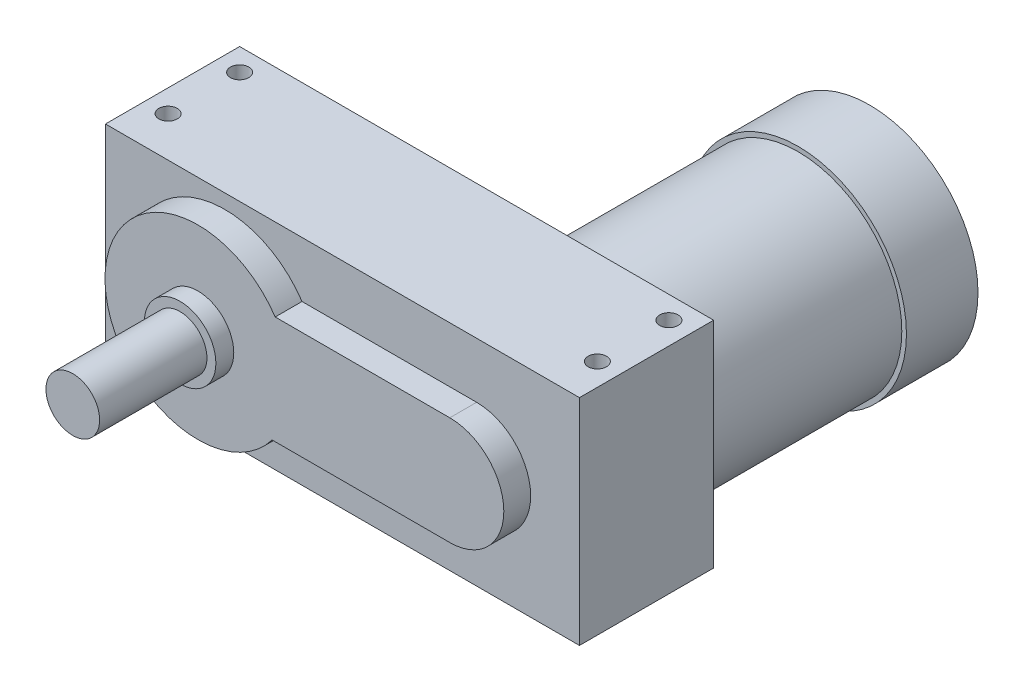
ISO-10303-21;
HEADER;
FILE_DESCRIPTION(('STEP AP214'),'2;1');
FILE_NAME('part.step','',(''),(''),'','','');
FILE_SCHEMA(('AUTOMOTIVE_DESIGN { 1 0 10303 214 1 1 1 1 }'));
ENDSEC;
DATA;
#1=APPLICATION_CONTEXT('core data for automotive mechanical design processes');
#2=APPLICATION_PROTOCOL_DEFINITION('international standard','automotive_design',2000,#1);
#3=PRODUCT_CONTEXT('',#1,'mechanical');
#4=PRODUCT('Part','Part','',(#3));
#5=PRODUCT_RELATED_PRODUCT_CATEGORY('part','',(#4));
#6=PRODUCT_DEFINITION_FORMATION('','',#4);
#7=PRODUCT_DEFINITION_CONTEXT('part definition',#1,'design');
#8=PRODUCT_DEFINITION('design','',#6,#7);
#9=PRODUCT_DEFINITION_SHAPE('','',#8);
#10=(LENGTH_UNIT() NAMED_UNIT(*) SI_UNIT(.MILLI.,.METRE.));
#11=(NAMED_UNIT(*) PLANE_ANGLE_UNIT() SI_UNIT($,.RADIAN.));
#12=(NAMED_UNIT(*) SI_UNIT($,.STERADIAN.) SOLID_ANGLE_UNIT());
#13=UNCERTAINTY_MEASURE_WITH_UNIT(LENGTH_MEASURE(1.E-05),#10,'distance_accuracy_value','');
#14=(GEOMETRIC_REPRESENTATION_CONTEXT(3) GLOBAL_UNCERTAINTY_ASSIGNED_CONTEXT((#13)) GLOBAL_UNIT_ASSIGNED_CONTEXT((#10,
#11,#12)) REPRESENTATION_CONTEXT('',''));
#15=CARTESIAN_POINT('',(0.,0.,0.));
#16=DIRECTION('',(0.,0.,1.));
#17=DIRECTION('',(1.,0.,0.));
#18=AXIS2_PLACEMENT_3D('',#15,#16,#17);
#19=CARTESIAN_POINT('',(-42.3672,38.1,-57.15));
#20=DIRECTION('',(-1.,0.,0.));
#21=DIRECTION('',(0.,0.,1.));
#22=AXIS2_PLACEMENT_3D('',#19,#20,#21);
#23=PLANE('',#22);
#24=DIRECTION('',(0.,0.,1.));
#25=VECTOR('',#24,1.);
#26=CARTESIAN_POINT('',(-42.3672,-38.1,-57.15));
#27=LINE('',#26,#25);
#28=CARTESIAN_POINT('',(-42.3672,-38.1,-57.15));
#29=VERTEX_POINT('',#28);
#30=CARTESIAN_POINT('',(-42.3672,-38.1,-9.525));
#31=VERTEX_POINT('',#30);
#32=EDGE_CURVE('E239',#29,#31,#27,.T.);
#33=ORIENTED_EDGE('',*,*,#32,.T.);
#34=DIRECTION('',(0.,1.,0.));
#35=VECTOR('',#34,1.);
#36=CARTESIAN_POINT('',(-42.3672,38.1,-9.52500000000001));
#37=LINE('',#36,#35);
#38=CARTESIAN_POINT('',(-42.3672,38.1,-9.52500000000001));
#39=VERTEX_POINT('',#38);
#40=EDGE_CURVE('E48',#31,#39,#37,.T.);
#41=ORIENTED_EDGE('',*,*,#40,.T.);
#42=DIRECTION('',(0.,0.,1.));
#43=VECTOR('',#42,1.);
#44=CARTESIAN_POINT('',(-42.3672,38.1,-57.15));
#45=LINE('',#44,#43);
#46=CARTESIAN_POINT('',(-42.3672,38.1,-57.15));
#47=VERTEX_POINT('',#46);
#48=EDGE_CURVE('E240',#47,#39,#45,.T.);
#49=ORIENTED_EDGE('',*,*,#48,.F.);
#50=DIRECTION('',(0.,-1.,0.));
#51=VECTOR('',#50,1.);
#52=CARTESIAN_POINT('',(-42.3672,38.1,-57.15));
#53=LINE('',#52,#51);
#54=EDGE_CURVE('E227',#47,#29,#53,.T.);
#55=ORIENTED_EDGE('',*,*,#54,.T.);
#56=EDGE_LOOP('',(#33,#41,#49,#55));
#57=FACE_BOUND('',#56,.T.);
#58=ADVANCED_FACE('F26',(#57),#23,.T.);
#59=CARTESIAN_POINT('',(-42.3672,38.1,-57.15));
#60=DIRECTION('',(0.,1.,0.));
#61=DIRECTION('',(0.,0.,1.));
#62=AXIS2_PLACEMENT_3D('',#59,#60,#61);
#63=PLANE('',#62);
#64=CARTESIAN_POINT('',(117.9703,38.1,-23.8125));
#65=DIRECTION('',(0.,1.,0.));
#66=DIRECTION('',(0.,0.,1.));
#67=AXIS2_PLACEMENT_3D('',#64,#65,#66);
#68=CIRCLE('',#67,3.26389999999999);
#69=CARTESIAN_POINT('',(117.9703,38.1,-20.5486));
#70=VERTEX_POINT('',#69);
#71=EDGE_CURVE('E179',#70,#70,#68,.T.);
#72=ORIENTED_EDGE('',*,*,#71,.F.);
#73=EDGE_LOOP('',(#72));
#74=FACE_BOUND('',#73,.T.);
#75=CARTESIAN_POINT('',(117.9703,38.1,-49.2125));
#76=DIRECTION('',(0.,1.,0.));
#77=DIRECTION('',(0.,0.,1.));
#78=AXIS2_PLACEMENT_3D('',#75,#76,#77);
#79=CIRCLE('',#78,3.26389999999999);
#80=CARTESIAN_POINT('',(117.9703,38.1,-45.9486));
#81=VERTEX_POINT('',#80);
#82=EDGE_CURVE('E173',#81,#81,#79,.T.);
#83=ORIENTED_EDGE('',*,*,#82,.F.);
#84=EDGE_LOOP('',(#83));
#85=FACE_BOUND('',#84,.T.);
#86=CARTESIAN_POINT('',(-34.4297,38.1,-49.2125));
#87=DIRECTION('',(0.,1.,0.));
#88=DIRECTION('',(0.,0.,1.));
#89=AXIS2_PLACEMENT_3D('',#86,#87,#88);
#90=CIRCLE('',#89,3.26389999999999);
#91=CARTESIAN_POINT('',(-34.4297,38.1,-45.9486));
#92=VERTEX_POINT('',#91);
#93=EDGE_CURVE('E167',#92,#92,#90,.T.);
#94=ORIENTED_EDGE('',*,*,#93,.F.);
#95=EDGE_LOOP('',(#94));
#96=FACE_BOUND('',#95,.T.);
#97=CARTESIAN_POINT('',(-34.4297,38.1,-23.8125));
#98=DIRECTION('',(0.,1.,0.));
#99=DIRECTION('',(0.,0.,1.));
#100=AXIS2_PLACEMENT_3D('',#97,#98,#99);
#101=CIRCLE('',#100,3.26389999999999);
#102=CARTESIAN_POINT('',(-34.4297,38.1,-20.5486));
#103=VERTEX_POINT('',#102);
#104=EDGE_CURVE('E161',#103,#103,#101,.T.);
#105=ORIENTED_EDGE('',*,*,#104,.F.);
#106=EDGE_LOOP('',(#105));
#107=FACE_BOUND('',#106,.T.);
#108=ORIENTED_EDGE('',*,*,#48,.T.);
#109=DIRECTION('',(1.,0.,0.));
#110=VECTOR('',#109,1.);
#111=CARTESIAN_POINT('',(-42.3672,38.1,-9.52500000000001));
#112=LINE('',#111,#110);
#113=CARTESIAN_POINT('',(125.9078,38.1,-9.525));
#114=VERTEX_POINT('',#113);
#115=EDGE_CURVE('E154',#39,#114,#112,.T.);
#116=ORIENTED_EDGE('',*,*,#115,.T.);
#117=DIRECTION('',(0.,0.,1.));
#118=VECTOR('',#117,1.);
#119=CARTESIAN_POINT('',(125.9078,38.1,-57.15));
#120=LINE('',#119,#118);
#121=CARTESIAN_POINT('',(125.9078,38.1,-57.15));
#122=VERTEX_POINT('',#121);
#123=EDGE_CURVE('E243',#122,#114,#120,.T.);
#124=ORIENTED_EDGE('',*,*,#123,.F.);
#125=DIRECTION('',(-1.,0.,0.));
#126=VECTOR('',#125,1.);
#127=CARTESIAN_POINT('',(-42.3672,38.1,-57.15));
#128=LINE('',#127,#126);
#129=EDGE_CURVE('E236',#122,#47,#128,.T.);
#130=ORIENTED_EDGE('',*,*,#129,.T.);
#131=EDGE_LOOP('',(#108,#116,#124,#130));
#132=FACE_BOUND('',#131,.T.);
#133=ADVANCED_FACE('F276',(#74,#85,#96,#107,#132),#63,.T.);
#134=CARTESIAN_POINT('',(125.9078,38.1,-57.15));
#135=DIRECTION('',(1.,0.,0.));
#136=DIRECTION('',(0.,0.,-1.));
#137=AXIS2_PLACEMENT_3D('',#134,#135,#136);
#138=PLANE('',#137);
#139=ORIENTED_EDGE('',*,*,#123,.T.);
#140=DIRECTION('',(0.,-1.,0.));
#141=VECTOR('',#140,1.);
#142=CARTESIAN_POINT('',(125.9078,38.1,-9.525));
#143=LINE('',#142,#141);
#144=CARTESIAN_POINT('',(125.9078,-38.1,-9.525));
#145=VERTEX_POINT('',#144);
#146=EDGE_CURVE('E148',#114,#145,#143,.T.);
#147=ORIENTED_EDGE('',*,*,#146,.T.);
#148=DIRECTION('',(0.,0.,1.));
#149=VECTOR('',#148,1.);
#150=CARTESIAN_POINT('',(125.9078,-38.1,-57.15));
#151=LINE('',#150,#149);
#152=CARTESIAN_POINT('',(125.9078,-38.1,-57.15));
#153=VERTEX_POINT('',#152);
#154=EDGE_CURVE('E246',#153,#145,#151,.T.);
#155=ORIENTED_EDGE('',*,*,#154,.F.);
#156=DIRECTION('',(0.,1.,0.));
#157=VECTOR('',#156,1.);
#158=CARTESIAN_POINT('',(125.9078,38.1,-57.15));
#159=LINE('',#158,#157);
#160=EDGE_CURVE('E233',#153,#122,#159,.T.);
#161=ORIENTED_EDGE('',*,*,#160,.T.);
#162=EDGE_LOOP('',(#139,#147,#155,#161));
#163=FACE_BOUND('',#162,.T.);
#164=ADVANCED_FACE('F270',(#163),#138,.T.);
#165=CARTESIAN_POINT('',(-42.3672,-38.1,-57.15));
#166=DIRECTION('',(0.,-1.,0.));
#167=DIRECTION('',(0.,0.,-1.));
#168=AXIS2_PLACEMENT_3D('',#165,#166,#167);
#169=PLANE('',#168);
#170=CARTESIAN_POINT('',(117.9703,-38.1,-23.8125));
#171=DIRECTION('',(0.,-1.,0.));
#172=DIRECTION('',(0.,0.,-1.));
#173=AXIS2_PLACEMENT_3D('',#170,#171,#172);
#174=CIRCLE('',#173,3.26389999999999);
#175=CARTESIAN_POINT('',(117.9703,-38.1,-27.0764));
#176=VERTEX_POINT('',#175);
#177=EDGE_CURVE('E212',#176,#176,#174,.T.);
#178=ORIENTED_EDGE('',*,*,#177,.F.);
#179=EDGE_LOOP('',(#178));
#180=FACE_BOUND('',#179,.T.);
#181=CARTESIAN_POINT('',(117.9703,-38.1,-49.2125));
#182=DIRECTION('',(0.,-1.,0.));
#183=DIRECTION('',(0.,0.,-1.));
#184=AXIS2_PLACEMENT_3D('',#181,#182,#183);
#185=CIRCLE('',#184,3.26389999999999);
#186=CARTESIAN_POINT('',(117.9703,-38.1,-52.4764));
#187=VERTEX_POINT('',#186);
#188=EDGE_CURVE('E206',#187,#187,#185,.T.);
#189=ORIENTED_EDGE('',*,*,#188,.F.);
#190=EDGE_LOOP('',(#189));
#191=FACE_BOUND('',#190,.T.);
#192=CARTESIAN_POINT('',(-34.4297,-38.1,-49.2125));
#193=DIRECTION('',(0.,-1.,0.));
#194=DIRECTION('',(0.,0.,-1.));
#195=AXIS2_PLACEMENT_3D('',#192,#193,#194);
#196=CIRCLE('',#195,3.26389999999999);
#197=CARTESIAN_POINT('',(-34.4297,-38.1,-52.4764));
#198=VERTEX_POINT('',#197);
#199=EDGE_CURVE('E200',#198,#198,#196,.T.);
#200=ORIENTED_EDGE('',*,*,#199,.F.);
#201=EDGE_LOOP('',(#200));
#202=FACE_BOUND('',#201,.T.);
#203=CARTESIAN_POINT('',(-34.4297,-38.1,-23.8125));
#204=DIRECTION('',(0.,-1.,0.));
#205=DIRECTION('',(0.,0.,-1.));
#206=AXIS2_PLACEMENT_3D('',#203,#204,#205);
#207=CIRCLE('',#206,3.26389999999999);
#208=CARTESIAN_POINT('',(-34.4297,-38.1,-27.0764));
#209=VERTEX_POINT('',#208);
#210=EDGE_CURVE('E194',#209,#209,#207,.T.);
#211=ORIENTED_EDGE('',*,*,#210,.F.);
#212=EDGE_LOOP('',(#211));
#213=FACE_BOUND('',#212,.T.);
#214=ORIENTED_EDGE('',*,*,#154,.T.);
#215=DIRECTION('',(-1.,0.,0.));
#216=VECTOR('',#215,1.);
#217=CARTESIAN_POINT('',(-42.3672,-38.1,-9.525));
#218=LINE('',#217,#216);
#219=EDGE_CURVE('E11',#145,#31,#218,.T.);
#220=ORIENTED_EDGE('',*,*,#219,.T.);
#221=ORIENTED_EDGE('',*,*,#32,.F.);
#222=DIRECTION('',(1.,0.,0.));
#223=VECTOR('',#222,1.);
#224=CARTESIAN_POINT('',(-42.3672,-38.1,-57.15));
#225=LINE('',#224,#223);
#226=EDGE_CURVE('E230',#29,#153,#225,.T.);
#227=ORIENTED_EDGE('',*,*,#226,.T.);
#228=EDGE_LOOP('',(#214,#220,#221,#227));
#229=FACE_BOUND('',#228,.T.);
#230=ADVANCED_FACE('F258',(#180,#191,#202,#213,#229),#169,.T.);
#231=CARTESIAN_POINT('',(-42.3672,-38.1,-57.15));
#232=DIRECTION('',(0.,0.,1.));
#233=DIRECTION('',(1.,0.,0.));
#234=AXIS2_PLACEMENT_3D('',#231,#232,#233);
#235=PLANE('',#234);
#236=ORIENTED_EDGE('',*,*,#54,.F.);
#237=ORIENTED_EDGE('',*,*,#129,.F.);
#238=ORIENTED_EDGE('',*,*,#160,.F.);
#239=ORIENTED_EDGE('',*,*,#226,.F.);
#240=EDGE_LOOP('',(#236,#237,#238,#239));
#241=FACE_BOUND('',#240,.T.);
#242=CARTESIAN_POINT('',(87.8078,0.,-57.15));
#243=DIRECTION('',(0.,0.,1.));
#244=DIRECTION('',(1.,0.,0.));
#245=AXIS2_PLACEMENT_3D('',#242,#243,#244);
#246=CIRCLE('',#245,36.83);
#247=CARTESIAN_POINT('',(124.6378,0.,-57.15));
#248=VERTEX_POINT('',#247);
#249=EDGE_CURVE('E33',#248,#248,#246,.F.);
#250=ORIENTED_EDGE('',*,*,#249,.F.);
#251=EDGE_LOOP('',(#250));
#252=FACE_BOUND('',#251,.T.);
#253=ADVANCED_FACE('F255',(#241,#252),#235,.F.);
#254=CARTESIAN_POINT('',(117.9703,-38.1,-23.8125));
#255=DIRECTION('',(0.,-1.,0.));
#256=DIRECTION('',(0.,0.,-1.));
#257=AXIS2_PLACEMENT_3D('',#254,#255,#256);
#258=CYLINDRICAL_SURFACE('',#257,3.26389999999999);
#259=CARTESIAN_POINT('',(117.9703,-15.1765,-23.8125));
#260=DIRECTION('',(0.,-1.,0.));
#261=DIRECTION('',(0.,0.,-1.));
#262=AXIS2_PLACEMENT_3D('',#259,#260,#261);
#263=CIRCLE('',#262,3.2639);
#264=CARTESIAN_POINT('',(117.9703,-15.1765,-27.0764));
#265=VERTEX_POINT('',#264);
#266=EDGE_CURVE('E209',#265,#265,#263,.T.);
#267=ORIENTED_EDGE('',*,*,#266,.F.);
#268=EDGE_LOOP('',(#267));
#269=FACE_BOUND('',#268,.T.);
#270=ORIENTED_EDGE('',*,*,#177,.T.);
#271=EDGE_LOOP('',(#270));
#272=FACE_BOUND('',#271,.T.);
#273=ADVANCED_FACE('F257',(#269,#272),#258,.F.);
#274=CARTESIAN_POINT('',(117.9703,-15.1765,-23.8125));
#275=DIRECTION('',(0.,-1.,0.));
#276=DIRECTION('',(0.,0.,-1.));
#277=AXIS2_PLACEMENT_3D('',#274,#275,#276);
#278=CONICAL_SURFACE('',#277,3.2639,1.02974425867665);
#279=CARTESIAN_POINT('',(117.9703,-13.215351025556,-23.8125));
#280=VERTEX_POINT('',#279);
#281=VERTEX_LOOP('',#280);
#282=FACE_BOUND('',#281,.T.);
#283=ORIENTED_EDGE('',*,*,#266,.T.);
#284=EDGE_LOOP('',(#283));
#285=FACE_BOUND('',#284,.T.);
#286=ADVANCED_FACE('F266',(#282,#285),#278,.F.);
#287=CARTESIAN_POINT('',(117.9703,-38.1,-49.2125));
#288=DIRECTION('',(0.,-1.,0.));
#289=DIRECTION('',(0.,0.,-1.));
#290=AXIS2_PLACEMENT_3D('',#287,#288,#289);
#291=CYLINDRICAL_SURFACE('',#290,3.26389999999999);
#292=CARTESIAN_POINT('',(117.9703,-15.1765,-49.2125));
#293=DIRECTION('',(0.,-1.,0.));
#294=DIRECTION('',(0.,0.,-1.));
#295=AXIS2_PLACEMENT_3D('',#292,#293,#294);
#296=CIRCLE('',#295,3.2639);
#297=CARTESIAN_POINT('',(117.9703,-15.1765,-52.4764));
#298=VERTEX_POINT('',#297);
#299=EDGE_CURVE('E203',#298,#298,#296,.T.);
#300=ORIENTED_EDGE('',*,*,#299,.F.);
#301=EDGE_LOOP('',(#300));
#302=FACE_BOUND('',#301,.T.);
#303=ORIENTED_EDGE('',*,*,#188,.T.);
#304=EDGE_LOOP('',(#303));
#305=FACE_BOUND('',#304,.T.);
#306=ADVANCED_FACE('F378',(#302,#305),#291,.F.);
#307=CARTESIAN_POINT('',(117.9703,-15.1765,-49.2125));
#308=DIRECTION('',(0.,-1.,0.));
#309=DIRECTION('',(0.,0.,-1.));
#310=AXIS2_PLACEMENT_3D('',#307,#308,#309);
#311=CONICAL_SURFACE('',#310,3.2639,1.02974425867665);
#312=CARTESIAN_POINT('',(117.9703,-13.215351025556,-49.2125));
#313=VERTEX_POINT('',#312);
#314=VERTEX_LOOP('',#313);
#315=FACE_BOUND('',#314,.T.);
#316=ORIENTED_EDGE('',*,*,#299,.T.);
#317=EDGE_LOOP('',(#316));
#318=FACE_BOUND('',#317,.T.);
#319=ADVANCED_FACE('F374',(#315,#318),#311,.F.);
#320=CARTESIAN_POINT('',(-34.4297,-38.1,-49.2125));
#321=DIRECTION('',(0.,-1.,0.));
#322=DIRECTION('',(0.,0.,-1.));
#323=AXIS2_PLACEMENT_3D('',#320,#321,#322);
#324=CYLINDRICAL_SURFACE('',#323,3.26389999999999);
#325=CARTESIAN_POINT('',(-34.4297,-15.1765,-49.2125));
#326=DIRECTION('',(0.,-1.,0.));
#327=DIRECTION('',(0.,0.,-1.));
#328=AXIS2_PLACEMENT_3D('',#325,#326,#327);
#329=CIRCLE('',#328,3.2639);
#330=CARTESIAN_POINT('',(-34.4297,-15.1765,-52.4764));
#331=VERTEX_POINT('',#330);
#332=EDGE_CURVE('E197',#331,#331,#329,.T.);
#333=ORIENTED_EDGE('',*,*,#332,.F.);
#334=EDGE_LOOP('',(#333));
#335=FACE_BOUND('',#334,.T.);
#336=ORIENTED_EDGE('',*,*,#199,.T.);
#337=EDGE_LOOP('',(#336));
#338=FACE_BOUND('',#337,.T.);
#339=ADVANCED_FACE('F370',(#335,#338),#324,.F.);
#340=CARTESIAN_POINT('',(-34.4297,-15.1765,-49.2125));
#341=DIRECTION('',(0.,-1.,0.));
#342=DIRECTION('',(0.,0.,-1.));
#343=AXIS2_PLACEMENT_3D('',#340,#341,#342);
#344=CONICAL_SURFACE('',#343,3.2639,1.02974425867665);
#345=CARTESIAN_POINT('',(-34.4297,-13.215351025556,-49.2125));
#346=VERTEX_POINT('',#345);
#347=VERTEX_LOOP('',#346);
#348=FACE_BOUND('',#347,.T.);
#349=ORIENTED_EDGE('',*,*,#332,.T.);
#350=EDGE_LOOP('',(#349));
#351=FACE_BOUND('',#350,.T.);
#352=ADVANCED_FACE('F366',(#348,#351),#344,.F.);
#353=CARTESIAN_POINT('',(-34.4297,-38.1,-23.8125));
#354=DIRECTION('',(0.,-1.,0.));
#355=DIRECTION('',(0.,0.,-1.));
#356=AXIS2_PLACEMENT_3D('',#353,#354,#355);
#357=CYLINDRICAL_SURFACE('',#356,3.26389999999999);
#358=CARTESIAN_POINT('',(-34.4297,-15.1765,-23.8125));
#359=DIRECTION('',(0.,-1.,0.));
#360=DIRECTION('',(0.,0.,-1.));
#361=AXIS2_PLACEMENT_3D('',#358,#359,#360);
#362=CIRCLE('',#361,3.2639);
#363=CARTESIAN_POINT('',(-34.4297,-15.1765,-27.0764));
#364=VERTEX_POINT('',#363);
#365=EDGE_CURVE('E191',#364,#364,#362,.T.);
#366=ORIENTED_EDGE('',*,*,#365,.F.);
#367=EDGE_LOOP('',(#366));
#368=FACE_BOUND('',#367,.T.);
#369=ORIENTED_EDGE('',*,*,#210,.T.);
#370=EDGE_LOOP('',(#369));
#371=FACE_BOUND('',#370,.T.);
#372=ADVANCED_FACE('F362',(#368,#371),#357,.F.);
#373=CARTESIAN_POINT('',(-34.4297,-15.1765,-23.8125));
#374=DIRECTION('',(0.,-1.,0.));
#375=DIRECTION('',(0.,0.,-1.));
#376=AXIS2_PLACEMENT_3D('',#373,#374,#375);
#377=CONICAL_SURFACE('',#376,3.2639,1.02974425867665);
#378=CARTESIAN_POINT('',(-34.4297,-13.215351025556,-23.8125));
#379=VERTEX_POINT('',#378);
#380=VERTEX_LOOP('',#379);
#381=FACE_BOUND('',#380,.T.);
#382=ORIENTED_EDGE('',*,*,#365,.T.);
#383=EDGE_LOOP('',(#382));
#384=FACE_BOUND('',#383,.T.);
#385=ADVANCED_FACE('F359',(#381,#384),#377,.F.);
#386=CARTESIAN_POINT('',(87.8078,0.,-125.222));
#387=DIRECTION('',(0.,0.,1.));
#388=DIRECTION('',(1.,0.,0.));
#389=AXIS2_PLACEMENT_3D('',#386,#387,#388);
#390=CYLINDRICAL_SURFACE('',#389,36.83);
#391=CARTESIAN_POINT('',(87.8078,0.,-125.222));
#392=DIRECTION('',(0.,0.,-1.));
#393=DIRECTION('',(-1.,0.,0.));
#394=AXIS2_PLACEMENT_3D('',#391,#392,#393);
#395=CIRCLE('',#394,36.83);
#396=CARTESIAN_POINT('',(50.9778,0.,-125.222));
#397=VERTEX_POINT('',#396);
#398=EDGE_CURVE('E188',#397,#397,#395,.T.);
#399=ORIENTED_EDGE('',*,*,#398,.F.);
#400=EDGE_LOOP('',(#399));
#401=FACE_BOUND('',#400,.T.);
#402=ORIENTED_EDGE('',*,*,#249,.T.);
#403=EDGE_LOOP('',(#402));
#404=FACE_BOUND('',#403,.T.);
#405=ADVANCED_FACE('F253',(#401,#404),#390,.T.);
#406=CARTESIAN_POINT('',(87.8078,0.,-125.222));
#407=DIRECTION('',(0.,0.,-1.));
#408=DIRECTION('',(-1.,0.,0.));
#409=AXIS2_PLACEMENT_3D('',#406,#407,#408);
#410=PLANE('',#409);
#411=CARTESIAN_POINT('',(87.8078,0.,-125.222));
#412=DIRECTION('',(0.,0.,-1.));
#413=DIRECTION('',(-1.,0.,0.));
#414=AXIS2_PLACEMENT_3D('',#411,#412,#413);
#415=CIRCLE('',#414,38.481);
#416=CARTESIAN_POINT('',(49.3268000000001,0.,-125.222));
#417=VERTEX_POINT('',#416);
#418=EDGE_CURVE('E182',#417,#417,#415,.T.);
#419=ORIENTED_EDGE('',*,*,#418,.F.);
#420=EDGE_LOOP('',(#419));
#421=FACE_BOUND('',#420,.T.);
#422=ORIENTED_EDGE('',*,*,#398,.T.);
#423=EDGE_LOOP('',(#422));
#424=FACE_BOUND('',#423,.T.);
#425=ADVANCED_FACE('F347',(#421,#424),#410,.F.);
#426=CARTESIAN_POINT('',(87.8078,0.,-150.622));
#427=DIRECTION('',(0.,0.,1.));
#428=DIRECTION('',(1.,0.,0.));
#429=AXIS2_PLACEMENT_3D('',#426,#427,#428);
#430=CYLINDRICAL_SURFACE('',#429,38.481);
#431=CARTESIAN_POINT('',(87.8078,0.,-150.622));
#432=DIRECTION('',(0.,0.,-1.));
#433=DIRECTION('',(-1.,0.,0.));
#434=AXIS2_PLACEMENT_3D('',#431,#432,#433);
#435=CIRCLE('',#434,38.481);
#436=CARTESIAN_POINT('',(49.3268000000001,0.,-150.622));
#437=VERTEX_POINT('',#436);
#438=EDGE_CURVE('E185',#437,#437,#435,.T.);
#439=ORIENTED_EDGE('',*,*,#438,.F.);
#440=EDGE_LOOP('',(#439));
#441=FACE_BOUND('',#440,.T.);
#442=ORIENTED_EDGE('',*,*,#418,.T.);
#443=EDGE_LOOP('',(#442));
#444=FACE_BOUND('',#443,.T.);
#445=ADVANCED_FACE('F350',(#441,#444),#430,.T.);
#446=CARTESIAN_POINT('',(87.8078,0.,-150.622));
#447=DIRECTION('',(0.,0.,-1.));
#448=DIRECTION('',(-1.,0.,0.));
#449=AXIS2_PLACEMENT_3D('',#446,#447,#448);
#450=PLANE('',#449);
#451=ORIENTED_EDGE('',*,*,#438,.T.);
#452=EDGE_LOOP('',(#451));
#453=FACE_BOUND('',#452,.T.);
#454=ADVANCED_FACE('F345',(#453),#450,.T.);
#455=CARTESIAN_POINT('',(117.9703,38.1,-23.8125));
#456=DIRECTION('',(0.,1.,0.));
#457=DIRECTION('',(0.,0.,1.));
#458=AXIS2_PLACEMENT_3D('',#455,#456,#457);
#459=CYLINDRICAL_SURFACE('',#458,3.26389999999999);
#460=CARTESIAN_POINT('',(117.9703,15.177008,-23.8125));
#461=DIRECTION('',(0.,1.,0.));
#462=DIRECTION('',(0.,0.,1.));
#463=AXIS2_PLACEMENT_3D('',#460,#461,#462);
#464=CIRCLE('',#463,3.2639);
#465=CARTESIAN_POINT('',(117.9703,15.177008,-20.5486));
#466=VERTEX_POINT('',#465);
#467=EDGE_CURVE('E176',#466,#466,#464,.T.);
#468=ORIENTED_EDGE('',*,*,#467,.F.);
#469=EDGE_LOOP('',(#468));
#470=FACE_BOUND('',#469,.T.);
#471=ORIENTED_EDGE('',*,*,#71,.T.);
#472=EDGE_LOOP('',(#471));
#473=FACE_BOUND('',#472,.T.);
#474=ADVANCED_FACE('F341',(#470,#473),#459,.F.);
#475=CARTESIAN_POINT('',(117.9703,15.177008,-23.8125));
#476=DIRECTION('',(0.,1.,0.));
#477=DIRECTION('',(0.,0.,1.));
#478=AXIS2_PLACEMENT_3D('',#475,#476,#477);
#479=CONICAL_SURFACE('',#478,3.2639,1.02974425867665);
#480=CARTESIAN_POINT('',(117.9703,13.215859025556,-23.8125));
#481=VERTEX_POINT('',#480);
#482=VERTEX_LOOP('',#481);
#483=FACE_BOUND('',#482,.T.);
#484=ORIENTED_EDGE('',*,*,#467,.T.);
#485=EDGE_LOOP('',(#484));
#486=FACE_BOUND('',#485,.T.);
#487=ADVANCED_FACE('F337',(#483,#486),#479,.F.);
#488=CARTESIAN_POINT('',(117.9703,38.1,-49.2125));
#489=DIRECTION('',(0.,1.,0.));
#490=DIRECTION('',(0.,0.,1.));
#491=AXIS2_PLACEMENT_3D('',#488,#489,#490);
#492=CYLINDRICAL_SURFACE('',#491,3.26389999999999);
#493=CARTESIAN_POINT('',(117.9703,15.177008,-49.2125));
#494=DIRECTION('',(0.,1.,0.));
#495=DIRECTION('',(0.,0.,1.));
#496=AXIS2_PLACEMENT_3D('',#493,#494,#495);
#497=CIRCLE('',#496,3.2639);
#498=CARTESIAN_POINT('',(117.9703,15.177008,-45.9486));
#499=VERTEX_POINT('',#498);
#500=EDGE_CURVE('E170',#499,#499,#497,.T.);
#501=ORIENTED_EDGE('',*,*,#500,.F.);
#502=EDGE_LOOP('',(#501));
#503=FACE_BOUND('',#502,.T.);
#504=ORIENTED_EDGE('',*,*,#82,.T.);
#505=EDGE_LOOP('',(#504));
#506=FACE_BOUND('',#505,.T.);
#507=ADVANCED_FACE('F333',(#503,#506),#492,.F.);
#508=CARTESIAN_POINT('',(117.9703,15.177008,-49.2125));
#509=DIRECTION('',(0.,1.,0.));
#510=DIRECTION('',(0.,0.,1.));
#511=AXIS2_PLACEMENT_3D('',#508,#509,#510);
#512=CONICAL_SURFACE('',#511,3.2639,1.02974425867665);
#513=CARTESIAN_POINT('',(117.9703,13.2158590255559,-49.2125));
#514=VERTEX_POINT('',#513);
#515=VERTEX_LOOP('',#514);
#516=FACE_BOUND('',#515,.T.);
#517=ORIENTED_EDGE('',*,*,#500,.T.);
#518=EDGE_LOOP('',(#517));
#519=FACE_BOUND('',#518,.T.);
#520=ADVANCED_FACE('F329',(#516,#519),#512,.F.);
#521=CARTESIAN_POINT('',(-34.4297,38.1,-49.2125));
#522=DIRECTION('',(0.,1.,0.));
#523=DIRECTION('',(0.,0.,1.));
#524=AXIS2_PLACEMENT_3D('',#521,#522,#523);
#525=CYLINDRICAL_SURFACE('',#524,3.26389999999999);
#526=CARTESIAN_POINT('',(-34.4297,15.177008,-49.2125));
#527=DIRECTION('',(0.,1.,0.));
#528=DIRECTION('',(0.,0.,1.));
#529=AXIS2_PLACEMENT_3D('',#526,#527,#528);
#530=CIRCLE('',#529,3.26389999999999);
#531=CARTESIAN_POINT('',(-34.4297,15.177008,-45.9486));
#532=VERTEX_POINT('',#531);
#533=EDGE_CURVE('E164',#532,#532,#530,.T.);
#534=ORIENTED_EDGE('',*,*,#533,.F.);
#535=EDGE_LOOP('',(#534));
#536=FACE_BOUND('',#535,.T.);
#537=ORIENTED_EDGE('',*,*,#93,.T.);
#538=EDGE_LOOP('',(#537));
#539=FACE_BOUND('',#538,.T.);
#540=ADVANCED_FACE('F325',(#536,#539),#525,.F.);
#541=CARTESIAN_POINT('',(-34.4297,15.177008,-49.2125));
#542=DIRECTION('',(0.,1.,0.));
#543=DIRECTION('',(0.,0.,1.));
#544=AXIS2_PLACEMENT_3D('',#541,#542,#543);
#545=CONICAL_SURFACE('',#544,3.26389999999999,1.02974425867665);
#546=CARTESIAN_POINT('',(-34.4297,13.2158590255559,-49.2125));
#547=VERTEX_POINT('',#546);
#548=VERTEX_LOOP('',#547);
#549=FACE_BOUND('',#548,.T.);
#550=ORIENTED_EDGE('',*,*,#533,.T.);
#551=EDGE_LOOP('',(#550));
#552=FACE_BOUND('',#551,.T.);
#553=ADVANCED_FACE('F321',(#549,#552),#545,.F.);
#554=CARTESIAN_POINT('',(-34.4297,38.1,-23.8125));
#555=DIRECTION('',(0.,1.,0.));
#556=DIRECTION('',(0.,0.,1.));
#557=AXIS2_PLACEMENT_3D('',#554,#555,#556);
#558=CYLINDRICAL_SURFACE('',#557,3.26389999999999);
#559=CARTESIAN_POINT('',(-34.4297000000001,15.177008,-23.8125));
#560=DIRECTION('',(0.,1.,0.));
#561=DIRECTION('',(0.,0.,1.));
#562=AXIS2_PLACEMENT_3D('',#559,#560,#561);
#563=CIRCLE('',#562,3.26389999999999);
#564=CARTESIAN_POINT('',(-34.4297000000001,15.177008,-20.5486));
#565=VERTEX_POINT('',#564);
#566=EDGE_CURVE('E158',#565,#565,#563,.T.);
#567=ORIENTED_EDGE('',*,*,#566,.F.);
#568=EDGE_LOOP('',(#567));
#569=FACE_BOUND('',#568,.T.);
#570=ORIENTED_EDGE('',*,*,#104,.T.);
#571=EDGE_LOOP('',(#570));
#572=FACE_BOUND('',#571,.T.);
#573=ADVANCED_FACE('F317',(#569,#572),#558,.F.);
#574=CARTESIAN_POINT('',(-34.4297000000001,15.177008,-23.8125));
#575=DIRECTION('',(0.,1.,0.));
#576=DIRECTION('',(0.,0.,1.));
#577=AXIS2_PLACEMENT_3D('',#574,#575,#576);
#578=CONICAL_SURFACE('',#577,3.26389999999999,1.02974425867665);
#579=CARTESIAN_POINT('',(-34.4297000000001,13.2158590255559,-23.8125));
#580=VERTEX_POINT('',#579);
#581=VERTEX_LOOP('',#580);
#582=FACE_BOUND('',#581,.T.);
#583=ORIENTED_EDGE('',*,*,#566,.T.);
#584=EDGE_LOOP('',(#583));
#585=FACE_BOUND('',#584,.T.);
#586=ADVANCED_FACE('F293',(#582,#585),#578,.F.);
#587=CARTESIAN_POINT('',(41.9608,0.,-9.525));
#588=DIRECTION('',(0.,0.,1.));
#589=DIRECTION('',(1.,0.,0.));
#590=AXIS2_PLACEMENT_3D('',#587,#588,#589);
#591=PLANE('',#590);
#592=ORIENTED_EDGE('',*,*,#219,.F.);
#593=ORIENTED_EDGE('',*,*,#146,.F.);
#594=ORIENTED_EDGE('',*,*,#115,.F.);
#595=ORIENTED_EDGE('',*,*,#40,.F.);
#596=EDGE_LOOP('',(#592,#593,#594,#595));
#597=FACE_BOUND('',#596,.T.);
#598=DIRECTION('',(1.,0.,0.));
#599=VECTOR('',#598,1.);
#600=CARTESIAN_POINT('',(26.3186365074519,-19.9411577494543,-9.525));
#601=LINE('',#600,#599);
#602=CARTESIAN_POINT('',(26.3186365074519,-19.9411577494543,-9.525));
#603=VERTEX_POINT('',#602);
#604=CARTESIAN_POINT('',(89.3930906443241,-19.9411577494543,-9.525));
#605=VERTEX_POINT('',#604);
#606=EDGE_CURVE('E145',#603,#605,#601,.T.);
#607=ORIENTED_EDGE('',*,*,#606,.F.);
#608=CARTESIAN_POINT('',(0.,0.,-9.525));
#609=DIRECTION('',(0.,0.,1.));
#610=DIRECTION('',(1.,0.,0.));
#611=AXIS2_PLACEMENT_3D('',#608,#609,#610);
#612=CIRCLE('',#611,33.02);
#613=CARTESIAN_POINT('',(27.4114089318005,18.4101890368787,-9.525));
#614=VERTEX_POINT('',#613);
#615=EDGE_CURVE('E115',#614,#603,#612,.T.);
#616=ORIENTED_EDGE('',*,*,#615,.F.);
#617=DIRECTION('',(-1.,0.,0.));
#618=VECTOR('',#617,1.);
#619=CARTESIAN_POINT('',(89.3930906443241,18.4101890368787,-9.525));
#620=LINE('',#619,#618);
#621=CARTESIAN_POINT('',(89.3930906443241,18.4101890368787,-9.525));
#622=VERTEX_POINT('',#621);
#623=EDGE_CURVE('E141',#622,#614,#620,.T.);
#624=ORIENTED_EDGE('',*,*,#623,.F.);
#625=CARTESIAN_POINT('',(89.3930906443241,-0.765484356287829,-9.52500000000001));
#626=DIRECTION('',(0.,0.,1.));
#627=DIRECTION('',(-1.,0.,0.));
#628=AXIS2_PLACEMENT_3D('',#625,#626,#627);
#629=CIRCLE('',#628,19.1756733931665);
#630=EDGE_CURVE('E128',#605,#622,#629,.T.);
#631=ORIENTED_EDGE('',*,*,#630,.F.);
#632=EDGE_LOOP('',(#607,#616,#624,#631));
#633=FACE_BOUND('',#632,.T.);
#634=ADVANCED_FACE('F288',(#597,#633),#591,.T.);
#635=CARTESIAN_POINT('',(89.3930906443241,-0.765484356287829,-9.52500000000001));
#636=DIRECTION('',(0.,0.,1.));
#637=DIRECTION('',(1.,0.,0.));
#638=AXIS2_PLACEMENT_3D('',#635,#636,#637);
#639=CYLINDRICAL_SURFACE('',#638,19.1756733931665);
#640=CARTESIAN_POINT('',(89.3930906443241,-0.765484356287822,0.));
#641=DIRECTION('',(0.,0.,1.));
#642=DIRECTION('',(-1.,0.,0.));
#643=AXIS2_PLACEMENT_3D('',#640,#641,#642);
#644=CIRCLE('',#643,19.1756733931665);
#645=CARTESIAN_POINT('',(89.3930906443241,-19.9411577494543,0.));
#646=VERTEX_POINT('',#645);
#647=CARTESIAN_POINT('',(89.3930906443241,18.4101890368787,0.));
#648=VERTEX_POINT('',#647);
#649=EDGE_CURVE('E135',#646,#648,#644,.T.);
#650=ORIENTED_EDGE('',*,*,#649,.F.);
#651=DIRECTION('',(0.,0.,1.));
#652=VECTOR('',#651,1.);
#653=CARTESIAN_POINT('',(89.3930906443241,-19.9411577494543,-9.525));
#654=LINE('',#653,#652);
#655=EDGE_CURVE('E119',#605,#646,#654,.T.);
#656=ORIENTED_EDGE('',*,*,#655,.F.);
#657=ORIENTED_EDGE('',*,*,#630,.T.);
#658=DIRECTION('',(0.,0.,1.));
#659=VECTOR('',#658,1.);
#660=CARTESIAN_POINT('',(89.3930906443241,18.4101890368787,-9.525));
#661=LINE('',#660,#659);
#662=EDGE_CURVE('E147',#622,#648,#661,.T.);
#663=ORIENTED_EDGE('',*,*,#662,.T.);
#664=EDGE_LOOP('',(#650,#656,#657,#663));
#665=FACE_BOUND('',#664,.T.);
#666=ADVANCED_FACE('F292',(#665),#639,.T.);
#667=CARTESIAN_POINT('',(26.3186365074519,-19.9411577494543,-9.525));
#668=DIRECTION('',(0.,-1.,0.));
#669=DIRECTION('',(1.,0.,0.));
#670=AXIS2_PLACEMENT_3D('',#667,#668,#669);
#671=PLANE('',#670);
#672=DIRECTION('',(1.,0.,0.));
#673=VECTOR('',#672,1.);
#674=CARTESIAN_POINT('',(26.3186365074519,-19.9411577494543,0.));
#675=LINE('',#674,#673);
#676=CARTESIAN_POINT('',(26.3186365074519,-19.9411577494543,0.));
#677=VERTEX_POINT('',#676);
#678=EDGE_CURVE('E123',#677,#646,#675,.T.);
#679=ORIENTED_EDGE('',*,*,#678,.F.);
#680=DIRECTION('',(0.,0.,1.));
#681=VECTOR('',#680,1.);
#682=CARTESIAN_POINT('',(26.3186365074519,-19.9411577494543,-9.525));
#683=LINE('',#682,#681);
#684=EDGE_CURVE('E112',#603,#677,#683,.T.);
#685=ORIENTED_EDGE('',*,*,#684,.F.);
#686=ORIENTED_EDGE('',*,*,#606,.T.);
#687=ORIENTED_EDGE('',*,*,#655,.T.);
#688=EDGE_LOOP('',(#679,#685,#686,#687));
#689=FACE_BOUND('',#688,.T.);
#690=ADVANCED_FACE('F124',(#689),#671,.T.);
#691=CARTESIAN_POINT('',(0.,0.,-9.525));
#692=DIRECTION('',(0.,0.,1.));
#693=DIRECTION('',(1.,0.,0.));
#694=AXIS2_PLACEMENT_3D('',#691,#692,#693);
#695=CYLINDRICAL_SURFACE('',#694,33.02);
#696=CARTESIAN_POINT('',(0.,0.,0.));
#697=DIRECTION('',(0.,0.,1.));
#698=DIRECTION('',(1.,0.,0.));
#699=AXIS2_PLACEMENT_3D('',#696,#697,#698);
#700=CIRCLE('',#699,33.02);
#701=CARTESIAN_POINT('',(27.4114089318005,18.4101890368787,0.));
#702=VERTEX_POINT('',#701);
#703=EDGE_CURVE('E40',#702,#677,#700,.T.);
#704=ORIENTED_EDGE('',*,*,#703,.F.);
#705=DIRECTION('',(0.,0.,1.));
#706=VECTOR('',#705,1.);
#707=CARTESIAN_POINT('',(27.4114089318005,18.4101890368787,-9.525));
#708=LINE('',#707,#706);
#709=EDGE_CURVE('E120',#614,#702,#708,.T.);
#710=ORIENTED_EDGE('',*,*,#709,.F.);
#711=ORIENTED_EDGE('',*,*,#615,.T.);
#712=ORIENTED_EDGE('',*,*,#684,.T.);
#713=EDGE_LOOP('',(#704,#710,#711,#712));
#714=FACE_BOUND('',#713,.T.);
#715=ADVANCED_FACE('F114',(#714),#695,.T.);
#716=CARTESIAN_POINT('',(89.3930906443241,18.4101890368787,-9.525));
#717=DIRECTION('',(0.,1.,0.));
#718=DIRECTION('',(-1.,0.,0.));
#719=AXIS2_PLACEMENT_3D('',#716,#717,#718);
#720=PLANE('',#719);
#721=DIRECTION('',(-1.,0.,0.));
#722=VECTOR('',#721,1.);
#723=CARTESIAN_POINT('',(89.3930906443241,18.4101890368787,0.));
#724=LINE('',#723,#722);
#725=EDGE_CURVE('E133',#648,#702,#724,.T.);
#726=ORIENTED_EDGE('',*,*,#725,.F.);
#727=ORIENTED_EDGE('',*,*,#662,.F.);
#728=ORIENTED_EDGE('',*,*,#623,.T.);
#729=ORIENTED_EDGE('',*,*,#709,.T.);
#730=EDGE_LOOP('',(#726,#727,#728,#729));
#731=FACE_BOUND('',#730,.T.);
#732=ADVANCED_FACE('F299',(#731),#720,.T.);
#733=CARTESIAN_POINT('',(0.,0.,44.45));
#734=DIRECTION('',(0.,0.,1.));
#735=DIRECTION('',(1.,0.,0.));
#736=AXIS2_PLACEMENT_3D('',#733,#734,#735);
#737=PLANE('',#736);
#738=CARTESIAN_POINT('',(0.,0.,44.45));
#739=DIRECTION('',(0.,0.,1.));
#740=DIRECTION('',(1.,0.,0.));
#741=AXIS2_PLACEMENT_3D('',#738,#739,#740);
#742=CIRCLE('',#741,9.525);
#743=CARTESIAN_POINT('',(9.525,0.,44.45));
#744=VERTEX_POINT('',#743);
#745=EDGE_CURVE('E218',#744,#744,#742,.T.);
#746=ORIENTED_EDGE('',*,*,#745,.T.);
#747=EDGE_LOOP('',(#746));
#748=FACE_BOUND('',#747,.T.);
#749=ADVANCED_FACE('F301',(#748),#737,.T.);
#750=CARTESIAN_POINT('',(0.,0.,44.45));
#751=DIRECTION('',(0.,0.,-1.));
#752=DIRECTION('',(-1.,0.,0.));
#753=AXIS2_PLACEMENT_3D('',#750,#751,#752);
#754=CYLINDRICAL_SURFACE('',#753,9.525);
#755=ORIENTED_EDGE('',*,*,#745,.F.);
#756=EDGE_LOOP('',(#755));
#757=FACE_BOUND('',#756,.T.);
#758=CARTESIAN_POINT('',(0.,0.,6.35000000000001));
#759=DIRECTION('',(0.,0.,1.));
#760=DIRECTION('',(1.,0.,0.));
#761=AXIS2_PLACEMENT_3D('',#758,#759,#760);
#762=CIRCLE('',#761,9.525);
#763=CARTESIAN_POINT('',(9.525,0.,6.35000000000001));
#764=VERTEX_POINT('',#763);
#765=EDGE_CURVE('E215',#764,#764,#762,.T.);
#766=ORIENTED_EDGE('',*,*,#765,.T.);
#767=EDGE_LOOP('',(#766));
#768=FACE_BOUND('',#767,.T.);
#769=ADVANCED_FACE('F307',(#757,#768),#754,.T.);
#770=CARTESIAN_POINT('',(0.,0.,6.35000000000001));
#771=DIRECTION('',(0.,0.,1.));
#772=DIRECTION('',(1.,0.,0.));
#773=AXIS2_PLACEMENT_3D('',#770,#771,#772);
#774=PLANE('',#773);
#775=CARTESIAN_POINT('',(0.,0.,6.35000000000001));
#776=DIRECTION('',(0.,0.,1.));
#777=DIRECTION('',(1.,0.,0.));
#778=AXIS2_PLACEMENT_3D('',#775,#776,#777);
#779=CIRCLE('',#778,12.7);
#780=CARTESIAN_POINT('',(12.7,0.,6.35000000000001));
#781=VERTEX_POINT('',#780);
#782=EDGE_CURVE('E224',#781,#781,#779,.T.);
#783=ORIENTED_EDGE('',*,*,#782,.T.);
#784=EDGE_LOOP('',(#783));
#785=FACE_BOUND('',#784,.T.);
#786=ORIENTED_EDGE('',*,*,#765,.F.);
#787=EDGE_LOOP('',(#786));
#788=FACE_BOUND('',#787,.T.);
#789=ADVANCED_FACE('F388',(#785,#788),#774,.T.);
#790=CARTESIAN_POINT('',(0.,0.,6.35000000000001));
#791=DIRECTION('',(0.,0.,-1.));
#792=DIRECTION('',(-1.,0.,0.));
#793=AXIS2_PLACEMENT_3D('',#790,#791,#792);
#794=CYLINDRICAL_SURFACE('',#793,12.7);
#795=ORIENTED_EDGE('',*,*,#782,.F.);
#796=EDGE_LOOP('',(#795));
#797=FACE_BOUND('',#796,.T.);
#798=CARTESIAN_POINT('',(0.,0.,0.));
#799=DIRECTION('',(0.,0.,1.));
#800=DIRECTION('',(1.,0.,0.));
#801=AXIS2_PLACEMENT_3D('',#798,#799,#800);
#802=CIRCLE('',#801,12.7);
#803=CARTESIAN_POINT('',(12.7,0.,0.));
#804=VERTEX_POINT('',#803);
#805=EDGE_CURVE('E221',#804,#804,#802,.T.);
#806=ORIENTED_EDGE('',*,*,#805,.T.);
#807=EDGE_LOOP('',(#806));
#808=FACE_BOUND('',#807,.T.);
#809=ADVANCED_FACE('F392',(#797,#808),#794,.T.);
#810=CARTESIAN_POINT('',(-42.3672,-38.1,0.));
#811=DIRECTION('',(0.,0.,1.));
#812=DIRECTION('',(1.,0.,0.));
#813=AXIS2_PLACEMENT_3D('',#810,#811,#812);
#814=PLANE('',#813);
#815=ORIENTED_EDGE('',*,*,#805,.F.);
#816=EDGE_LOOP('',(#815));
#817=FACE_BOUND('',#816,.T.);
#818=ORIENTED_EDGE('',*,*,#678,.T.);
#819=ORIENTED_EDGE('',*,*,#649,.T.);
#820=ORIENTED_EDGE('',*,*,#725,.T.);
#821=ORIENTED_EDGE('',*,*,#703,.T.);
#822=EDGE_LOOP('',(#818,#819,#820,#821));
#823=FACE_BOUND('',#822,.T.);
#824=ADVANCED_FACE('F131',(#817,#823),#814,.T.);
#825=CLOSED_SHELL('',(#58,#133,#164,#230,#253,#273,#286,#306,#319,#339,#352,#372,#385,#405,#425,
#445,#454,#474,#487,#507,#520,#540,#553,#573,#586,#634,#666,#690,#715,#732,#749,#769,#789,#809,#824));
#826=MANIFOLD_SOLID_BREP('B2',#825);
#827=ADVANCED_BREP_SHAPE_REPRESENTATION('',(#18,#826),#14);
#828=SHAPE_DEFINITION_REPRESENTATION(#9,#827);
ENDSEC;
END-ISO-10303-21;
